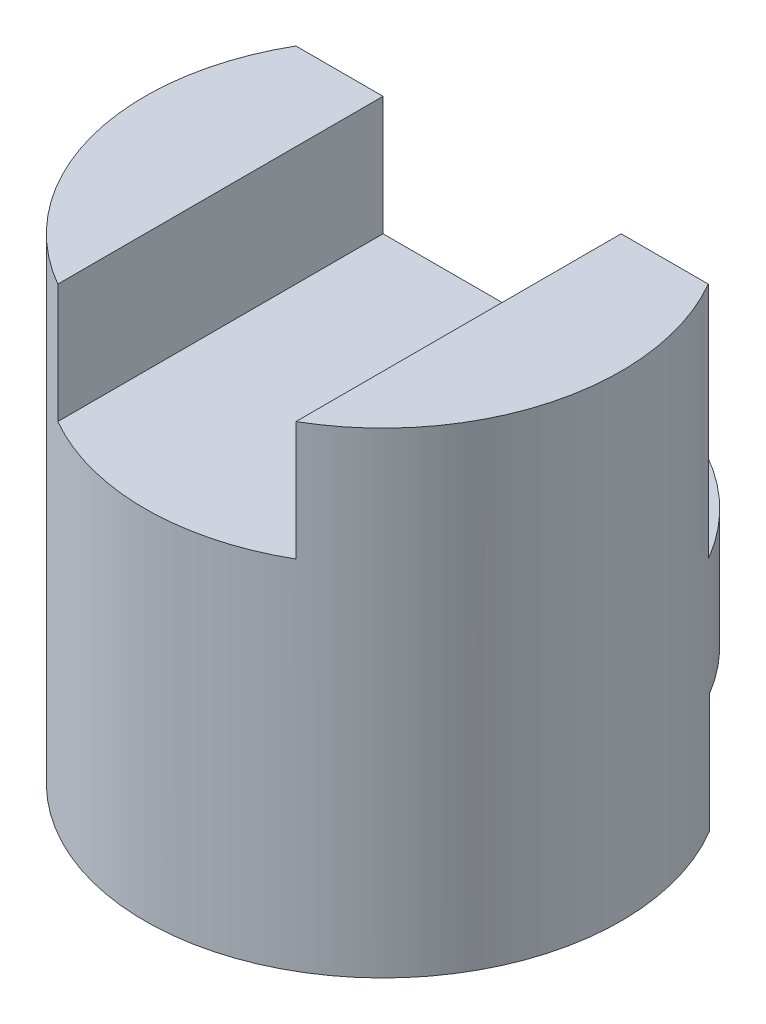
ISO-10303-21;
HEADER;
FILE_DESCRIPTION(('STEP AP214'),'2;1');
FILE_NAME('part.step','',(''),(''),'','','');
FILE_SCHEMA(('AUTOMOTIVE_DESIGN { 1 0 10303 214 1 1 1 1 }'));
ENDSEC;
DATA;
#1=APPLICATION_CONTEXT('core data for automotive mechanical design processes');
#2=APPLICATION_PROTOCOL_DEFINITION('international standard','automotive_design',2000,#1);
#3=PRODUCT_CONTEXT('',#1,'mechanical');
#4=PRODUCT('Part','Part','',(#3));
#5=PRODUCT_RELATED_PRODUCT_CATEGORY('part','',(#4));
#6=PRODUCT_DEFINITION_FORMATION('','',#4);
#7=PRODUCT_DEFINITION_CONTEXT('part definition',#1,'design');
#8=PRODUCT_DEFINITION('design','',#6,#7);
#9=PRODUCT_DEFINITION_SHAPE('','',#8);
#10=(LENGTH_UNIT() NAMED_UNIT(*) SI_UNIT(.MILLI.,.METRE.));
#11=(NAMED_UNIT(*) PLANE_ANGLE_UNIT() SI_UNIT($,.RADIAN.));
#12=(NAMED_UNIT(*) SI_UNIT($,.STERADIAN.) SOLID_ANGLE_UNIT());
#13=UNCERTAINTY_MEASURE_WITH_UNIT(LENGTH_MEASURE(1.E-05),#10,'distance_accuracy_value','');
#14=(GEOMETRIC_REPRESENTATION_CONTEXT(3) GLOBAL_UNCERTAINTY_ASSIGNED_CONTEXT((#13)) GLOBAL_UNIT_ASSIGNED_CONTEXT((#10,
#11,#12)) REPRESENTATION_CONTEXT('',''));
#15=CARTESIAN_POINT('',(0.,0.,0.));
#16=DIRECTION('',(0.,0.,1.));
#17=DIRECTION('',(1.,0.,0.));
#18=AXIS2_PLACEMENT_3D('',#15,#16,#17);
#19=CARTESIAN_POINT('',(0.,4.,0.));
#20=DIRECTION('',(0.,1.,0.));
#21=DIRECTION('',(0.,0.,1.));
#22=AXIS2_PLACEMENT_3D('',#19,#20,#21);
#23=PLANE('',#22);
#24=DIRECTION('',(1.,0.,0.));
#25=VECTOR('',#24,1.);
#26=CARTESIAN_POINT('',(-1.73205080756888,4.,-1.));
#27=LINE('',#26,#25);
#28=CARTESIAN_POINT('',(-1.73205080756888,4.,-1.));
#29=VERTEX_POINT('',#28);
#30=CARTESIAN_POINT('',(-1.,4.,-1.));
#31=VERTEX_POINT('',#30);
#32=EDGE_CURVE('E117',#29,#31,#27,.T.);
#33=ORIENTED_EDGE('',*,*,#32,.F.);
#34=CARTESIAN_POINT('',(0.,4.,0.));
#35=DIRECTION('',(0.,1.,0.));
#36=DIRECTION('',(0.,0.,1.));
#37=AXIS2_PLACEMENT_3D('',#34,#35,#36);
#38=CIRCLE('',#37,2.);
#39=CARTESIAN_POINT('',(-1.,4.,1.73205080756888));
#40=VERTEX_POINT('',#39);
#41=EDGE_CURVE('E144',#29,#40,#38,.T.);
#42=ORIENTED_EDGE('',*,*,#41,.T.);
#43=DIRECTION('',(0.,0.,1.));
#44=VECTOR('',#43,1.);
#45=CARTESIAN_POINT('',(-1.,4.,0.));
#46=LINE('',#45,#44);
#47=EDGE_CURVE('E148',#31,#40,#46,.T.);
#48=ORIENTED_EDGE('',*,*,#47,.F.);
#49=EDGE_LOOP('',(#33,#42,#48));
#50=FACE_BOUND('',#49,.T.);
#51=ADVANCED_FACE('F33',(#50),#23,.T.);
#52=CARTESIAN_POINT('',(0.,4.,0.));
#53=DIRECTION('',(0.,-1.,0.));
#54=DIRECTION('',(0.,0.,-1.));
#55=AXIS2_PLACEMENT_3D('',#52,#53,#54);
#56=CYLINDRICAL_SURFACE('',#55,2.);
#57=ORIENTED_EDGE('',*,*,#41,.F.);
#58=DIRECTION('',(0.,1.,0.));
#59=VECTOR('',#58,1.);
#60=CARTESIAN_POINT('',(-1.73205080756888,2.,-1.));
#61=LINE('',#60,#59);
#62=CARTESIAN_POINT('',(-1.73205080756888,2.,-1.));
#63=VERTEX_POINT('',#62);
#64=EDGE_CURVE('E120',#63,#29,#61,.T.);
#65=ORIENTED_EDGE('',*,*,#64,.F.);
#66=CARTESIAN_POINT('',(0.,2.,0.));
#67=DIRECTION('',(0.,1.,0.));
#68=DIRECTION('',(0.,0.,-1.));
#69=AXIS2_PLACEMENT_3D('',#66,#67,#68);
#70=CIRCLE('',#69,2.);
#71=CARTESIAN_POINT('',(1.73205080756888,2.,-1.));
#72=VERTEX_POINT('',#71);
#73=EDGE_CURVE('E114',#72,#63,#70,.T.);
#74=ORIENTED_EDGE('',*,*,#73,.F.);
#75=DIRECTION('',(0.,1.,0.));
#76=VECTOR('',#75,1.);
#77=CARTESIAN_POINT('',(1.73205080756888,2.,-1.));
#78=LINE('',#77,#76);
#79=CARTESIAN_POINT('',(1.73205080756888,4.,-1.));
#80=VERTEX_POINT('',#79);
#81=EDGE_CURVE('E122',#72,#80,#78,.T.);
#82=ORIENTED_EDGE('',*,*,#81,.T.);
#83=CARTESIAN_POINT('',(1.,4.,1.73205080756888));
#84=VERTEX_POINT('',#83);
#85=EDGE_CURVE('E140',#84,#80,#38,.T.);
#86=ORIENTED_EDGE('',*,*,#85,.F.);
#87=DIRECTION('',(0.,-1.,0.));
#88=VECTOR('',#87,1.);
#89=CARTESIAN_POINT('',(1.,4.,1.73205080756888));
#90=LINE('',#89,#88);
#91=CARTESIAN_POINT('',(1.,3.,1.73205080756888));
#92=VERTEX_POINT('',#91);
#93=EDGE_CURVE('E133',#84,#92,#90,.T.);
#94=ORIENTED_EDGE('',*,*,#93,.T.);
#95=CARTESIAN_POINT('',(0.,3.,0.));
#96=DIRECTION('',(0.,-1.,0.));
#97=DIRECTION('',(0.,0.,-1.));
#98=AXIS2_PLACEMENT_3D('',#95,#96,#97);
#99=CIRCLE('',#98,2.);
#100=CARTESIAN_POINT('',(-1.,3.,1.73205080756888));
#101=VERTEX_POINT('',#100);
#102=EDGE_CURVE('E151',#92,#101,#99,.T.);
#103=ORIENTED_EDGE('',*,*,#102,.T.);
#104=DIRECTION('',(0.,-1.,0.));
#105=VECTOR('',#104,1.);
#106=CARTESIAN_POINT('',(-1.,4.,1.73205080756888));
#107=LINE('',#106,#105);
#108=EDGE_CURVE('E137',#101,#40,#107,.F.);
#109=ORIENTED_EDGE('',*,*,#108,.T.);
#110=EDGE_LOOP('',(#57,#65,#74,#82,#86,#94,#103,#109));
#111=FACE_BOUND('',#110,.T.);
#112=CARTESIAN_POINT('',(0.,1.,0.));
#113=DIRECTION('',(0.,1.,0.));
#114=DIRECTION('',(0.,0.,1.));
#115=AXIS2_PLACEMENT_3D('',#112,#113,#114);
#116=CIRCLE('',#115,2.);
#117=CARTESIAN_POINT('',(1.72016871316566,1.,-1.02030367942392));
#118=VERTEX_POINT('',#117);
#119=CARTESIAN_POINT('',(-1.72016871316566,1.,-1.02030367942392));
#120=VERTEX_POINT('',#119);
#121=EDGE_CURVE('E11',#118,#120,#116,.T.);
#122=ORIENTED_EDGE('',*,*,#121,.T.);
#123=DIRECTION('',(0.,-1.,0.));
#124=VECTOR('',#123,1.);
#125=CARTESIAN_POINT('',(-1.72016871316566,1.,-1.02030367942392));
#126=LINE('',#125,#124);
#127=CARTESIAN_POINT('',(-1.72016871316566,0.,-1.02030367942392));
#128=VERTEX_POINT('',#127);
#129=EDGE_CURVE('E103',#120,#128,#126,.T.);
#130=ORIENTED_EDGE('',*,*,#129,.T.);
#131=CARTESIAN_POINT('',(0.,0.,0.));
#132=DIRECTION('',(0.,1.,0.));
#133=DIRECTION('',(0.,0.,1.));
#134=AXIS2_PLACEMENT_3D('',#131,#132,#133);
#135=CIRCLE('',#134,2.);
#136=CARTESIAN_POINT('',(1.72016871316566,0.,-1.02030367942392));
#137=VERTEX_POINT('',#136);
#138=EDGE_CURVE('E108',#128,#137,#135,.T.);
#139=ORIENTED_EDGE('',*,*,#138,.T.);
#140=DIRECTION('',(0.,-1.,0.));
#141=VECTOR('',#140,1.);
#142=CARTESIAN_POINT('',(1.72016871316566,1.,-1.02030367942392));
#143=LINE('',#142,#141);
#144=EDGE_CURVE('E48',#118,#137,#143,.T.);
#145=ORIENTED_EDGE('',*,*,#144,.F.);
#146=EDGE_LOOP('',(#122,#130,#139,#145));
#147=FACE_BOUND('',#146,.T.);
#148=ADVANCED_FACE('F35',(#111,#147),#56,.T.);
#149=CARTESIAN_POINT('',(0.999999999999999,4.,-1.));
#150=VERTEX_POINT('',#149);
#151=EDGE_CURVE('E110',#150,#80,#27,.T.);
#152=ORIENTED_EDGE('',*,*,#151,.F.);
#153=DIRECTION('',(0.,0.,-1.));
#154=VECTOR('',#153,1.);
#155=CARTESIAN_POINT('',(1.,4.,0.));
#156=LINE('',#155,#154);
#157=EDGE_CURVE('E143',#84,#150,#156,.T.);
#158=ORIENTED_EDGE('',*,*,#157,.F.);
#159=ORIENTED_EDGE('',*,*,#85,.T.);
#160=EDGE_LOOP('',(#152,#158,#159));
#161=FACE_BOUND('',#160,.T.);
#162=ADVANCED_FACE('F167',(#161),#23,.T.);
#163=CARTESIAN_POINT('',(0.,0.,0.));
#164=DIRECTION('',(0.,1.,0.));
#165=DIRECTION('',(0.,0.,1.));
#166=AXIS2_PLACEMENT_3D('',#163,#164,#165);
#167=PLANE('',#166);
#168=ORIENTED_EDGE('',*,*,#138,.F.);
#169=DIRECTION('',(-1.,0.,0.));
#170=VECTOR('',#169,1.);
#171=CARTESIAN_POINT('',(1.72016871316566,0.,-1.02030367942392));
#172=LINE('',#171,#170);
#173=EDGE_CURVE('E104',#137,#128,#172,.T.);
#174=ORIENTED_EDGE('',*,*,#173,.F.);
#175=EDGE_LOOP('',(#168,#174));
#176=FACE_BOUND('',#175,.T.);
#177=ADVANCED_FACE('F186',(#176),#167,.F.);
#178=CARTESIAN_POINT('',(-1.,3.,-5.));
#179=DIRECTION('',(0.,-1.,0.));
#180=DIRECTION('',(0.,0.,-1.));
#181=AXIS2_PLACEMENT_3D('',#178,#179,#180);
#182=PLANE('',#181);
#183=DIRECTION('',(0.,0.,1.));
#184=VECTOR('',#183,1.);
#185=CARTESIAN_POINT('',(1.,3.,-5.));
#186=LINE('',#185,#184);
#187=CARTESIAN_POINT('',(1.,3.,-1.));
#188=VERTEX_POINT('',#187);
#189=EDGE_CURVE('E131',#188,#92,#186,.T.);
#190=ORIENTED_EDGE('',*,*,#189,.F.);
#191=DIRECTION('',(-1.,0.,0.));
#192=VECTOR('',#191,1.);
#193=CARTESIAN_POINT('',(-1.,3.,-1.));
#194=LINE('',#193,#192);
#195=CARTESIAN_POINT('',(-1.,3.,-1.));
#196=VERTEX_POINT('',#195);
#197=EDGE_CURVE('E56',#188,#196,#194,.T.);
#198=ORIENTED_EDGE('',*,*,#197,.T.);
#199=DIRECTION('',(0.,0.,1.));
#200=VECTOR('',#199,1.);
#201=CARTESIAN_POINT('',(-1.,3.,-5.));
#202=LINE('',#201,#200);
#203=EDGE_CURVE('E130',#196,#101,#202,.T.);
#204=ORIENTED_EDGE('',*,*,#203,.T.);
#205=ORIENTED_EDGE('',*,*,#102,.F.);
#206=EDGE_LOOP('',(#190,#198,#204,#205));
#207=FACE_BOUND('',#206,.T.);
#208=ADVANCED_FACE('F160',(#207),#182,.F.);
#209=CARTESIAN_POINT('',(-1.,4.,-5.));
#210=DIRECTION('',(-1.,0.,0.));
#211=DIRECTION('',(0.,-1.,0.));
#212=AXIS2_PLACEMENT_3D('',#209,#210,#211);
#213=PLANE('',#212);
#214=ORIENTED_EDGE('',*,*,#203,.F.);
#215=DIRECTION('',(0.,1.,0.));
#216=VECTOR('',#215,1.);
#217=CARTESIAN_POINT('',(-1.,4.,-1.));
#218=LINE('',#217,#216);
#219=EDGE_CURVE('E127',#196,#31,#218,.T.);
#220=ORIENTED_EDGE('',*,*,#219,.T.);
#221=ORIENTED_EDGE('',*,*,#47,.T.);
#222=ORIENTED_EDGE('',*,*,#108,.F.);
#223=EDGE_LOOP('',(#214,#220,#221,#222));
#224=FACE_BOUND('',#223,.T.);
#225=ADVANCED_FACE('F178',(#224),#213,.F.);
#226=CARTESIAN_POINT('',(1.,4.,-5.));
#227=DIRECTION('',(1.,0.,0.));
#228=DIRECTION('',(0.,0.,-1.));
#229=AXIS2_PLACEMENT_3D('',#226,#227,#228);
#230=PLANE('',#229);
#231=ORIENTED_EDGE('',*,*,#157,.T.);
#232=DIRECTION('',(0.,-1.,0.));
#233=VECTOR('',#232,1.);
#234=CARTESIAN_POINT('',(1.,4.,-1.));
#235=LINE('',#234,#233);
#236=EDGE_CURVE('E41',#150,#188,#235,.T.);
#237=ORIENTED_EDGE('',*,*,#236,.T.);
#238=ORIENTED_EDGE('',*,*,#189,.T.);
#239=ORIENTED_EDGE('',*,*,#93,.F.);
#240=EDGE_LOOP('',(#231,#237,#238,#239));
#241=FACE_BOUND('',#240,.T.);
#242=ADVANCED_FACE('F155',(#241),#230,.F.);
#243=CARTESIAN_POINT('',(-1.73205080756888,2.,-1.));
#244=DIRECTION('',(0.,0.,1.));
#245=DIRECTION('',(1.,0.,0.));
#246=AXIS2_PLACEMENT_3D('',#243,#244,#245);
#247=PLANE('',#246);
#248=ORIENTED_EDGE('',*,*,#197,.F.);
#249=ORIENTED_EDGE('',*,*,#236,.F.);
#250=ORIENTED_EDGE('',*,*,#151,.T.);
#251=ORIENTED_EDGE('',*,*,#81,.F.);
#252=DIRECTION('',(1.,0.,0.));
#253=VECTOR('',#252,1.);
#254=CARTESIAN_POINT('',(-1.73205080756888,2.,-1.));
#255=LINE('',#254,#253);
#256=EDGE_CURVE('E116',#63,#72,#255,.T.);
#257=ORIENTED_EDGE('',*,*,#256,.F.);
#258=ORIENTED_EDGE('',*,*,#64,.T.);
#259=ORIENTED_EDGE('',*,*,#32,.T.);
#260=ORIENTED_EDGE('',*,*,#219,.F.);
#261=EDGE_LOOP('',(#248,#249,#250,#251,#257,#258,#259,#260));
#262=FACE_BOUND('',#261,.T.);
#263=ADVANCED_FACE('F168',(#262),#247,.F.);
#264=CARTESIAN_POINT('',(0.,2.,0.));
#265=DIRECTION('',(0.,-1.,0.));
#266=DIRECTION('',(0.,0.,-1.));
#267=AXIS2_PLACEMENT_3D('',#264,#265,#266);
#268=PLANE('',#267);
#269=ORIENTED_EDGE('',*,*,#73,.T.);
#270=ORIENTED_EDGE('',*,*,#256,.T.);
#271=EDGE_LOOP('',(#269,#270));
#272=FACE_BOUND('',#271,.T.);
#273=ADVANCED_FACE('F173',(#272),#268,.F.);
#274=CARTESIAN_POINT('',(0.,1.,-0.0203036794239192));
#275=DIRECTION('',(0.,1.,0.));
#276=DIRECTION('',(0.,0.,1.));
#277=AXIS2_PLACEMENT_3D('',#274,#275,#276);
#278=PLANE('',#277);
#279=DIRECTION('',(-1.,0.,0.));
#280=VECTOR('',#279,1.);
#281=CARTESIAN_POINT('',(1.72016871316566,1.,-1.02030367942392));
#282=LINE('',#281,#280);
#283=EDGE_CURVE('E99',#118,#120,#282,.T.);
#284=ORIENTED_EDGE('',*,*,#283,.T.);
#285=ORIENTED_EDGE('',*,*,#121,.F.);
#286=EDGE_LOOP('',(#284,#285));
#287=FACE_BOUND('',#286,.T.);
#288=ADVANCED_FACE('F98',(#287),#278,.F.);
#289=CARTESIAN_POINT('',(1.72016871316566,1.,-1.02030367942392));
#290=DIRECTION('',(0.,0.,1.));
#291=DIRECTION('',(1.,0.,0.));
#292=AXIS2_PLACEMENT_3D('',#289,#290,#291);
#293=PLANE('',#292);
#294=ORIENTED_EDGE('',*,*,#173,.T.);
#295=ORIENTED_EDGE('',*,*,#129,.F.);
#296=ORIENTED_EDGE('',*,*,#283,.F.);
#297=ORIENTED_EDGE('',*,*,#144,.T.);
#298=EDGE_LOOP('',(#294,#295,#296,#297));
#299=FACE_BOUND('',#298,.T.);
#300=ADVANCED_FACE('F102',(#299),#293,.F.);
#301=CLOSED_SHELL('',(#51,#148,#162,#177,#208,#225,#242,#263,#273,#288,#300));
#302=MANIFOLD_SOLID_BREP('B2',#301);
#303=ADVANCED_BREP_SHAPE_REPRESENTATION('',(#18,#302),#14);
#304=SHAPE_DEFINITION_REPRESENTATION(#9,#303);
ENDSEC;
END-ISO-10303-21;
